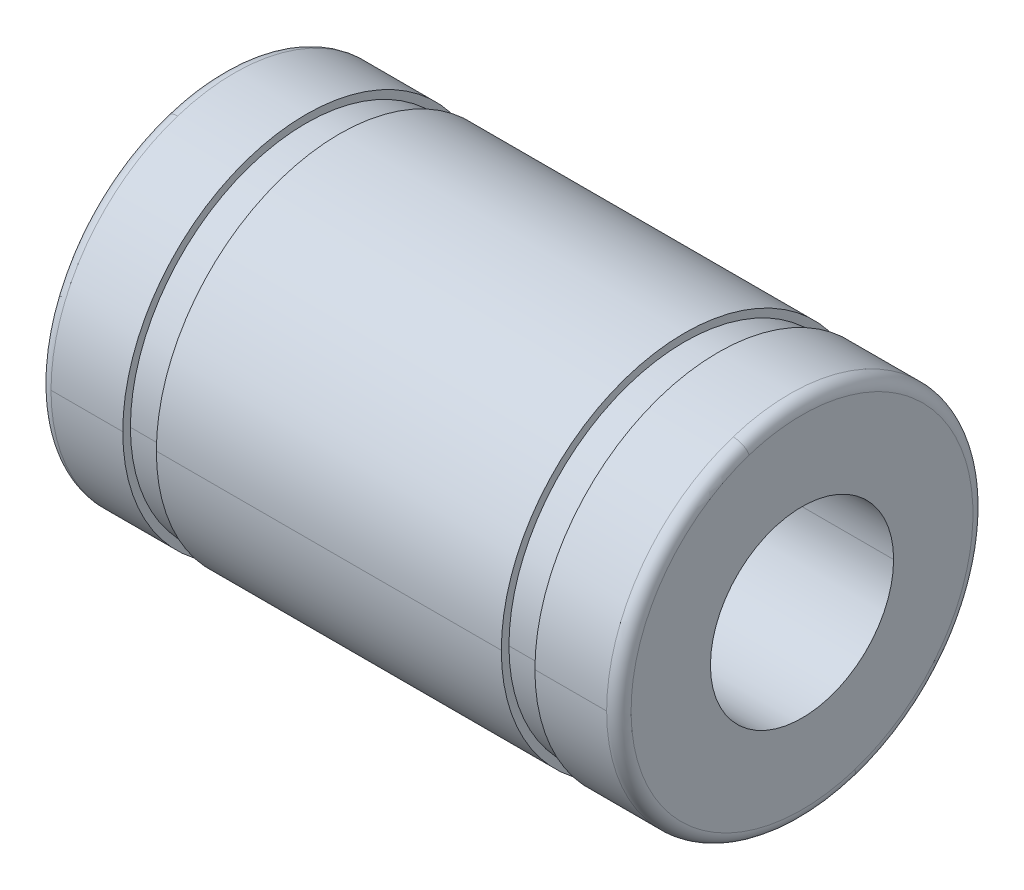
ISO-10303-21;
HEADER;
FILE_DESCRIPTION(('STEP AP214'),'2;1');
FILE_NAME('part.step','',(''),(''),'','','');
FILE_SCHEMA(('AUTOMOTIVE_DESIGN { 1 0 10303 214 1 1 1 1 }'));
ENDSEC;
DATA;
#1=APPLICATION_CONTEXT('core data for automotive mechanical design processes');
#2=APPLICATION_PROTOCOL_DEFINITION('international standard','automotive_design',2000,#1);
#3=PRODUCT_CONTEXT('',#1,'mechanical');
#4=PRODUCT('Part','Part','',(#3));
#5=PRODUCT_RELATED_PRODUCT_CATEGORY('part','',(#4));
#6=PRODUCT_DEFINITION_FORMATION('','',#4);
#7=PRODUCT_DEFINITION_CONTEXT('part definition',#1,'design');
#8=PRODUCT_DEFINITION('design','',#6,#7);
#9=PRODUCT_DEFINITION_SHAPE('','',#8);
#10=(LENGTH_UNIT() NAMED_UNIT(*) SI_UNIT(.MILLI.,.METRE.));
#11=(NAMED_UNIT(*) PLANE_ANGLE_UNIT() SI_UNIT($,.RADIAN.));
#12=(NAMED_UNIT(*) SI_UNIT($,.STERADIAN.) SOLID_ANGLE_UNIT());
#13=UNCERTAINTY_MEASURE_WITH_UNIT(LENGTH_MEASURE(1.E-05),#10,'distance_accuracy_value','');
#14=(GEOMETRIC_REPRESENTATION_CONTEXT(3) GLOBAL_UNCERTAINTY_ASSIGNED_CONTEXT((#13)) GLOBAL_UNIT_ASSIGNED_CONTEXT((#10,
#11,#12)) REPRESENTATION_CONTEXT('',''));
#15=CARTESIAN_POINT('',(0.,0.,0.));
#16=DIRECTION('',(0.,0.,1.));
#17=DIRECTION('',(1.,0.,0.));
#18=AXIS2_PLACEMENT_3D('',#15,#16,#17);
#19=CARTESIAN_POINT('',(0.,5.6,0.));
#20=DIRECTION('',(-1.,0.,0.));
#21=DIRECTION('',(0.,0.,1.));
#22=AXIS2_PLACEMENT_3D('',#19,#20,#21);
#23=PLANE('',#22);
#24=CARTESIAN_POINT('',(0.,0.,0.));
#25=DIRECTION('',(1.,0.,0.));
#26=DIRECTION('',(0.,0.,-1.));
#27=AXIS2_PLACEMENT_3D('',#24,#25,#26);
#28=CIRCLE('',#27,3.);
#29=CARTESIAN_POINT('',(0.,0.,-3.));
#30=VERTEX_POINT('',#29);
#31=CARTESIAN_POINT('',(0.,0.,3.));
#32=VERTEX_POINT('',#31);
#33=EDGE_CURVE('E11',#30,#32,#28,.T.);
#34=ORIENTED_EDGE('',*,*,#33,.T.);
#35=CARTESIAN_POINT('',(0.,0.,0.));
#36=DIRECTION('',(1.,0.,0.));
#37=DIRECTION('',(0.,0.,-1.));
#38=AXIS2_PLACEMENT_3D('',#35,#36,#37);
#39=CIRCLE('',#38,3.);
#40=EDGE_CURVE('E25',#32,#30,#39,.T.);
#41=ORIENTED_EDGE('',*,*,#40,.T.);
#42=EDGE_LOOP('',(#34,#41));
#43=FACE_BOUND('',#42,.T.);
#44=CARTESIAN_POINT('',(0.,5.32591649125286,1.7304951684997));
#45=CARTESIAN_POINT('',(0.,5.29760315024354,1.81764096194259));
#46=CARTESIAN_POINT('',(0.,5.26714736635499,1.90409045959508));
#47=CARTESIAN_POINT('',(0.,5.20203227012188,2.07539163474558));
#48=CARTESIAN_POINT('',(0.,5.16737295777732,2.16024331224361));
#49=CARTESIAN_POINT('',(0.,5.0939321619346,2.32814361851157));
#50=CARTESIAN_POINT('',(0.,5.05515067843645,2.4111922472815));
#51=CARTESIAN_POINT('',(0.,4.97355954169295,2.57528660263574));
#52=CARTESIAN_POINT('',(0.,4.9307498884476,2.65633232922005));
#53=CARTESIAN_POINT('',(0.,4.84120539076773,2.81622557554584));
#54=CARTESIAN_POINT('',(0.,4.79447054633323,2.89507309528731));
#55=CARTESIAN_POINT('',(0.,4.6971882957782,3.05037999299519));
#56=CARTESIAN_POINT('',(0.,4.64664088965768,3.12683937096161));
#57=CARTESIAN_POINT('',(0.,4.54185527782808,3.27718578358765));
#58=CARTESIAN_POINT('',(0.,4.487617072119,3.35107281824727));
#59=CARTESIAN_POINT('',(0.,4.37558052865639,3.49609654504506));
#60=CARTESIAN_POINT('',(0.,4.31778219090286,3.56723323718322));
#61=CARTESIAN_POINT('',(0.,4.19876462381749,3.70658490411483));
#62=CARTESIAN_POINT('',(0.,4.13754539448567,3.77479987890827));
#63=CARTESIAN_POINT('',(0.,4.01183352694158,3.90814377538189));
#64=CARTESIAN_POINT('',(0.,3.94734088872931,3.97327269706207));
#65=CARTESIAN_POINT('',(0.,3.81523757178182,4.10028758601061));
#66=CARTESIAN_POINT('',(0.,3.74762689304659,4.16217355327898));
#67=CARTESIAN_POINT('',(0.,3.60945037511548,4.28255344469395));
#68=CARTESIAN_POINT('',(0.,3.5388845359196,4.34104736884057));
#69=CARTESIAN_POINT('',(0.,3.39496769635055,4.45450225702377));
#70=CARTESIAN_POINT('',(0.,3.32161669597739,4.50946322106035));
#71=CARTESIAN_POINT('',(0.,3.17230624303957,4.61571978324752));
#72=CARTESIAN_POINT('',(0.,3.09634679047491,4.66701538139812));
#73=CARTESIAN_POINT('',(0.,2.9420024261283,4.76581763622429));
#74=CARTESIAN_POINT('',(0.,2.86361751434634,4.81332429289987));
#75=CARTESIAN_POINT('',(0.,2.7046110676834,4.90443421707902));
#76=CARTESIAN_POINT('',(0.,2.62398953280241,4.94803748458259));
#77=CARTESIAN_POINT('',(0.,2.46070406428052,5.03123558632712));
#78=CARTESIAN_POINT('',(0.,2.37804013063963,5.07083042056807));
#79=CARTESIAN_POINT('',(0.,2.21086900925457,5.14591626836356));
#80=CARTESIAN_POINT('',(0.,2.12636182151041,5.18140728191811));
#81=CARTESIAN_POINT('',(0.,1.95570777713607,5.24819998738049));
#82=CARTESIAN_POINT('',(0.,1.86956092050588,5.27950167928833));
#83=CARTESIAN_POINT('',(0.,1.69583507368268,5.33784033293979));
#84=CARTESIAN_POINT('',(0.,1.60825608348966,5.36487729468341));
#85=CARTESIAN_POINT('',(0.,1.43187695499918,5.41462135359744));
#86=CARTESIAN_POINT('',(0.,1.34307681670172,5.43732845076785));
#87=CARTESIAN_POINT('',(0.,1.16446931931348,5.47835807714945));
#88=CARTESIAN_POINT('',(0.,1.0746619602227,5.49668060636066));
#89=CARTESIAN_POINT('',(0.,0.894256375042082,5.52889695624612));
#90=CARTESIAN_POINT('',(0.,0.803658148952239,5.54279077692039));
#91=CARTESIAN_POINT('',(0.,0.621889088835604,5.56611623830102));
#92=CARTESIAN_POINT('',(0.,0.530718254808811,5.57554787900739));
#93=CARTESIAN_POINT('',(0.,0.348023617343068,5.58992625880365));
#94=CARTESIAN_POINT('',(0.,0.256499813904118,5.59487299789354));
#95=CARTESIAN_POINT('',(0.,0.0733197264730848,5.6002696573291));
#96=CARTESIAN_POINT('',(0.,-0.0183365575189982,5.60071957767477));
#97=CARTESIAN_POINT('',(0.,-0.20156079804002,5.59712151572436));
#98=CARTESIAN_POINT('',(0.,-0.29312875456896,5.59307353342828));
#99=CARTESIAN_POINT('',(0.,-0.475955744936008,5.58048941813829));
#100=CARTESIAN_POINT('',(0.,-0.567214778774118,5.57195328514438));
#101=CARTESIAN_POINT('',(0.,-0.749204072753645,5.55041343275079));
#102=CARTESIAN_POINT('',(0.,-0.839934332895063,5.53740971335111));
#103=CARTESIAN_POINT('',(0.,-1.02064750233749,5.50696601524499));
#104=CARTESIAN_POINT('',(0.,-1.1106304116385,5.48952603653856));
#105=CARTESIAN_POINT('',(0.,-1.28963210269004,5.45025183425521));
#106=CARTESIAN_POINT('',(0.,-1.37865088444057,5.4284176106783));
#107=CARTESIAN_POINT('',(0.,-1.55550986634878,5.38040751921104));
#108=CARTESIAN_POINT('',(0.,-1.64335006650647,5.35423165132069));
#109=CARTESIAN_POINT('',(0.,-1.81764027049292,5.29760133118504));
#110=CARTESIAN_POINT('',(0.,-1.90409027432169,5.26714687893974));
#111=CARTESIAN_POINT('',(0.,-2.07539182001895,5.20203275753714));
#112=CARTESIAN_POINT('',(0.,-2.16024336188745,5.16737308837985));
#113=CARTESIAN_POINT('',(0.,-2.3281435688677,5.09393203133209));
#114=CARTESIAN_POINT('',(0.,-2.41119223397946,5.05515064344162));
#115=CARTESIAN_POINT('',(0.,-2.57528661593776,4.9735595766878));
#116=CARTESIAN_POINT('',(0.,-2.65633233278431,4.93074989782444));
#117=CARTESIAN_POINT('',(0.,-2.81622557198156,4.8412053813909));
#118=CARTESIAN_POINT('',(0.,-2.89507309433226,4.79447054382072));
#119=CARTESIAN_POINT('',(0.,-3.05037999395023,4.69718829829072));
#120=CARTESIAN_POINT('',(0.,-3.1268393712175,4.64664089033091));
#121=CARTESIAN_POINT('',(0.,-3.27718578333174,4.54185527715486));
#122=CARTESIAN_POINT('',(0.,-3.3510728181787,4.48761707193862));
#123=CARTESIAN_POINT('',(0.,-3.49609654511363,4.37558052883679));
#124=CARTESIAN_POINT('',(0.,-3.56723323720159,4.3177821909512));
#125=CARTESIAN_POINT('',(0.,-3.70658490409644,4.19876462376916));
#126=CARTESIAN_POINT('',(0.,-3.77479987890333,4.13754539447272));
#127=CARTESIAN_POINT('',(0.,-3.9081437753868,4.01183352695453));
#128=CARTESIAN_POINT('',(0.,-3.97327269706338,3.94734088873279));
#129=CARTESIAN_POINT('',(0.,-4.10028758600929,3.81523757177835));
#130=CARTESIAN_POINT('',(0.,-4.16217355327862,3.74762689304567));
#131=CARTESIAN_POINT('',(0.,-4.2825534446943,3.60945037511642));
#132=CARTESIAN_POINT('',(0.,-4.34104736884066,3.53888453591985));
#133=CARTESIAN_POINT('',(0.,-4.45450225702367,3.39496769635031));
#134=CARTESIAN_POINT('',(0.,-4.50946322106032,3.32161669597733));
#135=CARTESIAN_POINT('',(0.,-4.61571978324754,3.17230624303964));
#136=CARTESIAN_POINT('',(0.,-4.66701538139812,3.09634679047494));
#137=CARTESIAN_POINT('',(0.,-4.76581763622427,2.94200242612829));
#138=CARTESIAN_POINT('',(0.,-4.81332429289986,2.86361751434635));
#139=CARTESIAN_POINT('',(0.,-4.90443421707902,2.70461106768341));
#140=CARTESIAN_POINT('',(0.,-4.94803748458259,2.62398953280242));
#141=CARTESIAN_POINT('',(0.,-5.03123558632711,2.46070406428053));
#142=CARTESIAN_POINT('',(0.,-5.07083042056806,2.37804013063964));
#143=CARTESIAN_POINT('',(0.,-5.14591626836356,2.21086900925458));
#144=CARTESIAN_POINT('',(0.,-5.18140728191812,2.12636182151042));
#145=CARTESIAN_POINT('',(0.,-5.24819998738047,1.95570777713609));
#146=CARTESIAN_POINT('',(0.,-5.27950167928825,1.86956092050591));
#147=CARTESIAN_POINT('',(0.,-5.33784033293985,1.69583507368267));
#148=CARTESIAN_POINT('',(0.,-5.36487729468366,1.6082560834896));
#149=CARTESIAN_POINT('',(0.,-5.41462135359718,1.43187695499926));
#150=CARTESIAN_POINT('',(0.,-5.43732845076688,1.34307681670199));
#151=CARTESIAN_POINT('',(0.,-5.47835807715041,1.16446931931323));
#152=CARTESIAN_POINT('',(0.,-5.49668060636424,1.07466196022174));
#153=CARTESIAN_POINT('',(0.,-5.52889695624254,0.894256375043066));
#154=CARTESIAN_POINT('',(0.,-5.54279077690702,0.803658148955882));
#155=CARTESIAN_POINT('',(0.,-5.56611623831439,0.621889088831987));
#156=CARTESIAN_POINT('',(0.,-5.57554787905729,0.530718254795276));
#157=CARTESIAN_POINT('',(0.,-5.58992625875374,0.348023617356626));
#158=CARTESIAN_POINT('',(0.,-5.59487299770729,0.256499813954687));
#159=CARTESIAN_POINT('',(0.,-5.60026965751534,0.0733197264225391));
#160=CARTESIAN_POINT('',(0.,-5.60071957836984,-0.0183365577076699));
#161=CARTESIAN_POINT('',(0.,-5.59712151502929,-0.201560797851326));
#162=CARTESIAN_POINT('',(0.,-5.59307353083425,-0.293128753864773));
#163=CARTESIAN_POINT('',(0.,-5.58048942073232,-0.47595574564017));
#164=CARTESIAN_POINT('',(0.,-5.57195329482543,-0.567214781402119));
#165=CARTESIAN_POINT('',(0.,-5.55041342306975,-0.749204070125617));
#166=CARTESIAN_POINT('',(0.,-5.53740967722095,-0.839934323087166));
#167=CARTESIAN_POINT('',(0.,-5.50696605137515,-1.02064751214536));
#168=CARTESIAN_POINT('',(0.,-5.48952617137815,-1.11063044824201));
#169=CARTESIAN_POINT('',(0.,-5.45025169941563,-1.28963206608651));
#170=CARTESIAN_POINT('',(0.,-5.42841710745012,-1.37865074783437));
#171=CARTESIAN_POINT('',(0.,-5.38040802243922,-1.55551000295496));
#172=CARTESIAN_POINT('',(0.,-5.35423352939385,-1.64335057632769));
#173=CARTESIAN_POINT('',(0.,-5.32591649125286,-1.73049516849968));
#174=B_SPLINE_CURVE_WITH_KNOTS('',3,(#44,#45,#46,#47,#48,#49,#50,#51,#52,#53,#54,#55,#56,#57,
#58,#59,#60,#61,#62,#63,#64,#65,#66,#67,#68,#69,#70,#71,#72,#73,#74,#75,#76,#77,#78,#79,#80,#81,
#82,#83,#84,#85,#86,#87,#88,#89,#90,#91,#92,#93,#94,#95,#96,#97,#98,#99,#100,#101,#102,#103,
#104,#105,#106,#107,#108,#109,#110,#111,#112,#113,#114,#115,#116,#117,#118,#119,#120,#121,#122,
#123,#124,#125,#126,#127,#128,#129,#130,#131,#132,#133,#134,#135,#136,#137,#138,#139,#140,#141,
#142,#143,#144,#145,#146,#147,#148,#149,#150,#151,#152,#153,#154,#155,#156,#157,#158,#159,#160,
#161,#162,#163,#164,#165,#166,#167,#168,#169,#170,#171,#172,#173),.UNSPECIFIED.,.F.,.F.,(4,2,2,
2,2,2,2,2,2,2,2,2,2,2,2,2,2,2,2,2,2,2,2,2,2,2,2,2,2,2,2,2,2,2,2,2,2,2,2,2,2,2,2,2,2,2,2,2,2,2,2,
2,2,2,2,2,2,2,2,2,2,2,2,2,4),(0.,0.274861759456618,0.549723518913234,0.824585278369852,
1.09944703782647,1.37430879728309,1.6491705567397,1.92403231619632,2.19889407565294,
2.47375583510956,2.74861759456617,3.02347935402279,3.29834111347941,3.57320287293602,
3.84806463239264,4.12292639184926,4.39778815130588,4.67264991076249,4.94751167021911,
5.22237342967573,5.49723518913235,5.77209694858896,6.04695870804558,6.3218204675022,
6.59668222695881,6.87154398641543,7.14640574587205,7.42126750532867,7.69612926478528,
7.9709910242419,8.24585278369852,8.52071454315513,8.79557630261175,9.07043806206837,
9.34529982152499,9.6201615809816,9.89502334043822,10.1698850998948,10.4447468593515,
10.7196086188081,10.9944703782647,11.2693321377213,11.5441938971779,11.8190556566345,
12.0939174160912,12.3687791755478,12.6436409350044,12.918502694461,13.1933644539176,
13.4682262133743,13.7430879728309,14.0179497322875,14.2928114917441,14.5676732512007,
14.8425350106573,15.1173967701139,15.3922585295706,15.6671202890272,15.9419820484838,
16.2168438079404,16.491705567397,16.7665673268537,17.0414290863103,17.3162908457669,
17.5911526052235),.UNSPECIFIED.);
#175=CARTESIAN_POINT('',(0.,5.32591649125286,1.7304951684997));
#176=VERTEX_POINT('',#175);
#177=CARTESIAN_POINT('',(0.,-5.32591649125286,-1.7304951684997));
#178=VERTEX_POINT('',#177);
#179=EDGE_CURVE('E439',#176,#178,#174,.T.);
#180=ORIENTED_EDGE('',*,*,#179,.F.);
#181=CARTESIAN_POINT('',(0.,-5.32591649125286,-1.7304951684997));
#182=CARTESIAN_POINT('',(0.,-5.29760315024354,-1.81764096194259));
#183=CARTESIAN_POINT('',(0.,-5.26714736635499,-1.90409045959508));
#184=CARTESIAN_POINT('',(0.,-5.20203227012188,-2.07539163474558));
#185=CARTESIAN_POINT('',(0.,-5.16737295777732,-2.16024331224361));
#186=CARTESIAN_POINT('',(0.,-5.0939321619346,-2.32814361851157));
#187=CARTESIAN_POINT('',(0.,-5.05515067843646,-2.4111922472815));
#188=CARTESIAN_POINT('',(0.,-4.97355954169295,-2.57528660263574));
#189=CARTESIAN_POINT('',(0.,-4.9307498884476,-2.65633232922005));
#190=CARTESIAN_POINT('',(0.,-4.84120539076774,-2.81622557554584));
#191=CARTESIAN_POINT('',(0.,-4.79447054633323,-2.89507309528731));
#192=CARTESIAN_POINT('',(0.,-4.6971882957782,-3.05037999299519));
#193=CARTESIAN_POINT('',(0.,-4.64664088965768,-3.1268393709616));
#194=CARTESIAN_POINT('',(0.,-4.54185527782808,-3.27718578358765));
#195=CARTESIAN_POINT('',(0.,-4.487617072119,-3.35107281824727));
#196=CARTESIAN_POINT('',(0.,-4.37558052865639,-3.49609654504506));
#197=CARTESIAN_POINT('',(0.,-4.31778219090286,-3.56723323718322));
#198=CARTESIAN_POINT('',(0.,-4.1987646238175,-3.70658490411482));
#199=CARTESIAN_POINT('',(0.,-4.13754539448567,-3.77479987890826));
#200=CARTESIAN_POINT('',(0.,-4.01183352694158,-3.90814377538189));
#201=CARTESIAN_POINT('',(0.,-3.94734088872931,-3.97327269706207));
#202=CARTESIAN_POINT('',(0.,-3.81523757178182,-4.10028758601061));
#203=CARTESIAN_POINT('',(0.,-3.74762689304659,-4.16217355327897));
#204=CARTESIAN_POINT('',(0.,-3.60945037511548,-4.28255344469395));
#205=CARTESIAN_POINT('',(0.,-3.5388845359196,-4.34104736884057));
#206=CARTESIAN_POINT('',(0.,-3.39496769635055,-4.45450225702376));
#207=CARTESIAN_POINT('',(0.,-3.32161669597739,-4.50946322106035));
#208=CARTESIAN_POINT('',(0.,-3.17230624303957,-4.61571978324752));
#209=CARTESIAN_POINT('',(0.,-3.09634679047491,-4.66701538139811));
#210=CARTESIAN_POINT('',(0.,-2.9420024261283,-4.76581763622429));
#211=CARTESIAN_POINT('',(0.,-2.86361751434634,-4.81332429289986));
#212=CARTESIAN_POINT('',(0.,-2.7046110676834,-4.90443421707902));
#213=CARTESIAN_POINT('',(0.,-2.62398953280241,-4.94803748458259));
#214=CARTESIAN_POINT('',(0.,-2.46070406428053,-5.03123558632712));
#215=CARTESIAN_POINT('',(0.,-2.37804013063963,-5.07083042056807));
#216=CARTESIAN_POINT('',(0.,-2.21086900925457,-5.14591626836356));
#217=CARTESIAN_POINT('',(0.,-2.12636182151042,-5.1814072819181));
#218=CARTESIAN_POINT('',(0.,-1.95570777713608,-5.24819998738049));
#219=CARTESIAN_POINT('',(0.,-1.86956092050589,-5.27950167928832));
#220=CARTESIAN_POINT('',(0.,-1.69583507368269,-5.33784033293978));
#221=CARTESIAN_POINT('',(0.,-1.60825608348967,-5.36487729468341));
#222=CARTESIAN_POINT('',(0.,-1.43187695499919,-5.41462135359744));
#223=CARTESIAN_POINT('',(0.,-1.34307681670172,-5.43732845076784));
#224=CARTESIAN_POINT('',(0.,-1.16446931931348,-5.47835807714945));
#225=CARTESIAN_POINT('',(0.,-1.07466196022271,-5.49668060636066));
#226=CARTESIAN_POINT('',(0.,-0.894256375042089,-5.52889695624612));
#227=CARTESIAN_POINT('',(0.,-0.803658148952246,-5.54279077692039));
#228=CARTESIAN_POINT('',(0.,-0.621889088835609,-5.56611623830102));
#229=CARTESIAN_POINT('',(0.,-0.530718254808816,-5.57554787900739));
#230=CARTESIAN_POINT('',(0.,-0.348023617343072,-5.58992625880365));
#231=CARTESIAN_POINT('',(0.,-0.256499813904122,-5.59487299789354));
#232=CARTESIAN_POINT('',(0.,-0.0733197264730882,-5.6002696573291));
#233=CARTESIAN_POINT('',(0.,0.0183365575189954,-5.60071957767477));
#234=CARTESIAN_POINT('',(0.,0.201560798040017,-5.59712151572436));
#235=CARTESIAN_POINT('',(0.,0.293128754568954,-5.59307353342828));
#236=CARTESIAN_POINT('',(0.,0.475955744936002,-5.58048941813829));
#237=CARTESIAN_POINT('',(0.,0.567214778774111,-5.57195328514439));
#238=CARTESIAN_POINT('',(0.,0.749204072753638,-5.55041343275079));
#239=CARTESIAN_POINT('',(0.,0.839934332895055,-5.53740971335111));
#240=CARTESIAN_POINT('',(0.,1.02064750233748,-5.50696601524499));
#241=CARTESIAN_POINT('',(0.,1.1106304116385,-5.48952603653856));
#242=CARTESIAN_POINT('',(0.,1.28963210269004,-5.45025183425521));
#243=CARTESIAN_POINT('',(0.,1.37865088444057,-5.4284176106783));
#244=CARTESIAN_POINT('',(0.,1.55550986634878,-5.38040751921104));
#245=CARTESIAN_POINT('',(0.,1.64335006650646,-5.35423165132069));
#246=CARTESIAN_POINT('',(0.,1.81764027049291,-5.29760133118504));
#247=CARTESIAN_POINT('',(0.,1.90409027432168,-5.26714687893974));
#248=CARTESIAN_POINT('',(0.,2.07539182001895,-5.20203275753715));
#249=CARTESIAN_POINT('',(0.,2.16024336188745,-5.16737308837985));
#250=CARTESIAN_POINT('',(0.,2.3281435688677,-5.09393203133209));
#251=CARTESIAN_POINT('',(0.,2.41119223397945,-5.05515064344162));
#252=CARTESIAN_POINT('',(0.,2.57528661593776,-4.9735595766878));
#253=CARTESIAN_POINT('',(0.,2.65633233278431,-4.93074989782444));
#254=CARTESIAN_POINT('',(0.,2.81622557198155,-4.8412053813909));
#255=CARTESIAN_POINT('',(0.,2.89507309433225,-4.79447054382072));
#256=CARTESIAN_POINT('',(0.,3.05037999395022,-4.69718829829073));
#257=CARTESIAN_POINT('',(0.,3.12683937121749,-4.64664089033091));
#258=CARTESIAN_POINT('',(0.,3.27718578333173,-4.54185527715486));
#259=CARTESIAN_POINT('',(0.,3.35107281817869,-4.48761707193862));
#260=CARTESIAN_POINT('',(0.,3.49609654511362,-4.37558052883679));
#261=CARTESIAN_POINT('',(0.,3.56723323720158,-4.3177821909512));
#262=CARTESIAN_POINT('',(0.,3.70658490409644,-4.19876462376917));
#263=CARTESIAN_POINT('',(0.,3.77479987890333,-4.13754539447273));
#264=CARTESIAN_POINT('',(0.,3.9081437753868,-4.01183352695454));
#265=CARTESIAN_POINT('',(0.,3.97327269706338,-3.94734088873279));
#266=CARTESIAN_POINT('',(0.,4.10028758600928,-3.81523757177836));
#267=CARTESIAN_POINT('',(0.,4.16217355327861,-3.74762689304567));
#268=CARTESIAN_POINT('',(0.,4.28255344469429,-3.60945037511642));
#269=CARTESIAN_POINT('',(0.,4.34104736884065,-3.53888453591986));
#270=CARTESIAN_POINT('',(0.,4.45450225702366,-3.39496769635032));
#271=CARTESIAN_POINT('',(0.,4.50946322106031,-3.32161669597734));
#272=CARTESIAN_POINT('',(0.,4.61571978324754,-3.17230624303965));
#273=CARTESIAN_POINT('',(0.,4.66701538139811,-3.09634679047495));
#274=CARTESIAN_POINT('',(0.,4.76581763622427,-2.9420024261283));
#275=CARTESIAN_POINT('',(0.,4.81332429289985,-2.86361751434635));
#276=CARTESIAN_POINT('',(0.,4.90443421707901,-2.70461106768342));
#277=CARTESIAN_POINT('',(0.,4.94803748458259,-2.62398953280243));
#278=CARTESIAN_POINT('',(0.,5.03123558632711,-2.46070406428054));
#279=CARTESIAN_POINT('',(0.,5.07083042056805,-2.37804013063964));
#280=CARTESIAN_POINT('',(0.,5.14591626836356,-2.21086900925459));
#281=CARTESIAN_POINT('',(0.,5.18140728191812,-2.12636182151043));
#282=CARTESIAN_POINT('',(0.,5.24819998738046,-1.95570777713609));
#283=CARTESIAN_POINT('',(0.,5.27950167928825,-1.86956092050592));
#284=CARTESIAN_POINT('',(0.,5.33784033293985,-1.69583507368268));
#285=CARTESIAN_POINT('',(0.,5.36487729468366,-1.60825608348961));
#286=CARTESIAN_POINT('',(0.,5.41462135359717,-1.43187695499927));
#287=CARTESIAN_POINT('',(0.,5.43732845076688,-1.343076816702));
#288=CARTESIAN_POINT('',(0.,5.47835807715041,-1.16446931931324));
#289=CARTESIAN_POINT('',(0.,5.49668060636424,-1.07466196022175));
#290=CARTESIAN_POINT('',(0.,5.52889695624254,-0.894256375043076));
#291=CARTESIAN_POINT('',(0.,5.54279077690701,-0.803658148955891));
#292=CARTESIAN_POINT('',(0.,5.56611623831439,-0.621889088831995));
#293=CARTESIAN_POINT('',(0.,5.57554787905729,-0.530718254795286));
#294=CARTESIAN_POINT('',(0.,5.58992625875374,-0.348023617356638));
#295=CARTESIAN_POINT('',(0.,5.59487299770729,-0.256499813954699));
#296=CARTESIAN_POINT('',(0.,5.60026965751534,-0.0733197264225513));
#297=CARTESIAN_POINT('',(0.,5.60071957836983,0.0183365577076577));
#298=CARTESIAN_POINT('',(0.,5.59712151502929,0.201560797851314));
#299=CARTESIAN_POINT('',(0.,5.59307353083425,0.293128753864761));
#300=CARTESIAN_POINT('',(0.,5.58048942073232,0.475955745640158));
#301=CARTESIAN_POINT('',(0.,5.57195329482543,0.567214781402107));
#302=CARTESIAN_POINT('',(0.,5.55041342306975,0.749204070125607));
#303=CARTESIAN_POINT('',(0.,5.53740967722095,0.839934323087157));
#304=CARTESIAN_POINT('',(0.,5.50696605137515,1.02064751214535));
#305=CARTESIAN_POINT('',(0.,5.48952617137815,1.110630448242));
#306=CARTESIAN_POINT('',(0.,5.45025169941563,1.28963206608651));
#307=CARTESIAN_POINT('',(0.,5.42841710745012,1.37865074783436));
#308=CARTESIAN_POINT('',(0.,5.38040802243923,1.55551000295495));
#309=CARTESIAN_POINT('',(0.,5.35423352939385,1.64335057632768));
#310=CARTESIAN_POINT('',(0.,5.32591649125287,1.73049516849967));
#311=B_SPLINE_CURVE_WITH_KNOTS('',3,(#181,#182,#183,#184,#185,#186,#187,#188,#189,#190,#191,
#192,#193,#194,#195,#196,#197,#198,#199,#200,#201,#202,#203,#204,#205,#206,#207,#208,#209,#210,
#211,#212,#213,#214,#215,#216,#217,#218,#219,#220,#221,#222,#223,#224,#225,#226,#227,#228,#229,
#230,#231,#232,#233,#234,#235,#236,#237,#238,#239,#240,#241,#242,#243,#244,#245,#246,#247,#248,
#249,#250,#251,#252,#253,#254,#255,#256,#257,#258,#259,#260,#261,#262,#263,#264,#265,#266,#267,
#268,#269,#270,#271,#272,#273,#274,#275,#276,#277,#278,#279,#280,#281,#282,#283,#284,#285,#286,
#287,#288,#289,#290,#291,#292,#293,#294,#295,#296,#297,#298,#299,#300,#301,#302,#303,#304,#305,
#306,#307,#308,#309,#310),.UNSPECIFIED.,.F.,.F.,(4,2,2,2,2,2,2,2,2,2,2,2,2,2,2,2,2,2,2,2,2,2,2,
2,2,2,2,2,2,2,2,2,2,2,2,2,2,2,2,2,2,2,2,2,2,2,2,2,2,2,2,2,2,2,2,2,2,2,2,2,2,2,2,2,4),(0.,
0.274861759456618,0.549723518913235,0.824585278369851,1.09944703782647,1.37430879728309,
1.6491705567397,1.92403231619632,2.19889407565294,2.47375583510955,2.74861759456617,
3.02347935402279,3.2983411134794,3.57320287293602,3.84806463239264,4.12292639184926,
4.39778815130587,4.67264991076249,4.94751167021911,5.22237342967573,5.49723518913234,
5.77209694858896,6.04695870804558,6.32182046750219,6.59668222695881,6.87154398641543,
7.14640574587205,7.42126750532866,7.69612926478528,7.9709910242419,8.24585278369851,
8.52071454315513,8.79557630261175,9.07043806206836,9.34529982152498,9.6201615809816,
9.89502334043822,10.1698850998948,10.4447468593514,10.7196086188081,10.9944703782647,
11.2693321377213,11.5441938971779,11.8190556566345,12.0939174160912,12.3687791755478,
12.6436409350044,12.918502694461,13.1933644539176,13.4682262133742,13.7430879728309,
14.0179497322875,14.2928114917441,14.5676732512007,14.8425350106573,15.1173967701139,
15.3922585295706,15.6671202890272,15.9419820484838,16.2168438079404,16.491705567397,
16.7665673268536,17.0414290863103,17.3162908457669,17.5911526052235),.UNSPECIFIED.);
#312=EDGE_CURVE('E441',#178,#176,#311,.T.);
#313=ORIENTED_EDGE('',*,*,#312,.F.);
#314=EDGE_LOOP('',(#180,#313));
#315=FACE_BOUND('',#314,.T.);
#316=ADVANCED_FACE('F16',(#43,#315),#23,.T.);
#317=CARTESIAN_POINT('',(0.40000000000003,0.,0.));
#318=DIRECTION('',(1.,0.,0.));
#319=DIRECTION('',(0.,-0.309016994374947,0.951056516295154));
#320=AXIS2_PLACEMENT_3D('',#317,#318,#319);
#321=TOROIDAL_SURFACE('',#320,5.6,0.40000000000003);
#322=CARTESIAN_POINT('',(0.40000000000003,-5.32591649125286,-1.7304951684997));
#323=DIRECTION('',(0.,0.309016994374948,-0.951056516295154));
#324=DIRECTION('',(0.,-0.951056516295154,-0.309016994374948));
#325=AXIS2_PLACEMENT_3D('',#322,#323,#324);
#326=CIRCLE('',#325,0.40000000000003);
#327=CARTESIAN_POINT('',(0.399999999999999,-5.70633909777095,-1.85410196624969));
#328=VERTEX_POINT('',#327);
#329=EDGE_CURVE('E360',#328,#178,#326,.T.);
#330=ORIENTED_EDGE('',*,*,#329,.T.);
#331=ORIENTED_EDGE('',*,*,#312,.T.);
#332=CARTESIAN_POINT('',(0.40000000000003,5.32591649125286,1.7304951684997));
#333=DIRECTION('',(0.,-0.309016994374948,0.951056516295154));
#334=DIRECTION('',(0.,0.951056516295154,0.309016994374948));
#335=AXIS2_PLACEMENT_3D('',#332,#333,#334);
#336=CIRCLE('',#335,0.40000000000003);
#337=CARTESIAN_POINT('',(0.399999999999999,5.70633909777095,1.85410196624969));
#338=VERTEX_POINT('',#337);
#339=EDGE_CURVE('E355',#338,#176,#336,.T.);
#340=ORIENTED_EDGE('',*,*,#339,.F.);
#341=CARTESIAN_POINT('',(0.4,0.,0.));
#342=DIRECTION('',(1.,0.,0.));
#343=DIRECTION('',(0.,0.,-1.));
#344=AXIS2_PLACEMENT_3D('',#341,#342,#343);
#345=CIRCLE('',#344,6.);
#346=CARTESIAN_POINT('',(0.4,0.,-6.));
#347=VERTEX_POINT('',#346);
#348=EDGE_CURVE('E350',#347,#338,#345,.T.);
#349=ORIENTED_EDGE('',*,*,#348,.F.);
#350=CARTESIAN_POINT('',(0.4,0.,0.));
#351=DIRECTION('',(1.,0.,0.));
#352=DIRECTION('',(0.,0.,-1.));
#353=AXIS2_PLACEMENT_3D('',#350,#351,#352);
#354=CIRCLE('',#353,6.);
#355=EDGE_CURVE('E345',#328,#347,#354,.T.);
#356=ORIENTED_EDGE('',*,*,#355,.F.);
#357=EDGE_LOOP('',(#330,#331,#340,#349,#356));
#358=FACE_BOUND('',#357,.T.);
#359=ADVANCED_FACE('F368',(#358),#321,.T.);
#360=CARTESIAN_POINT('',(19.,0.,0.));
#361=DIRECTION('',(1.,0.,0.));
#362=DIRECTION('',(0.,1.,0.));
#363=AXIS2_PLACEMENT_3D('',#360,#361,#362);
#364=CYLINDRICAL_SURFACE('',#363,6.);
#365=DIRECTION('',(1.,0.,0.));
#366=VECTOR('',#365,1.);
#367=CARTESIAN_POINT('',(0.399999999999999,0.,6.));
#368=LINE('',#367,#366);
#369=CARTESIAN_POINT('',(0.399999999999999,0.,6.));
#370=VERTEX_POINT('',#369);
#371=CARTESIAN_POINT('',(2.75,0.,6.));
#372=VERTEX_POINT('',#371);
#373=EDGE_CURVE('E340',#370,#372,#368,.T.);
#374=ORIENTED_EDGE('',*,*,#373,.F.);
#375=CARTESIAN_POINT('',(0.4,0.,0.));
#376=DIRECTION('',(1.,0.,0.));
#377=DIRECTION('',(0.,0.,-1.));
#378=AXIS2_PLACEMENT_3D('',#375,#376,#377);
#379=CIRCLE('',#378,6.);
#380=EDGE_CURVE('E335',#370,#328,#379,.T.);
#381=ORIENTED_EDGE('',*,*,#380,.T.);
#382=ORIENTED_EDGE('',*,*,#355,.T.);
#383=DIRECTION('',(1.,0.,0.));
#384=VECTOR('',#383,1.);
#385=CARTESIAN_POINT('',(0.399999999999999,0.,-6.));
#386=LINE('',#385,#384);
#387=CARTESIAN_POINT('',(2.75,0.,-6.));
#388=VERTEX_POINT('',#387);
#389=EDGE_CURVE('E331',#347,#388,#386,.T.);
#390=ORIENTED_EDGE('',*,*,#389,.T.);
#391=CARTESIAN_POINT('',(2.75,0.,0.));
#392=DIRECTION('',(1.,0.,0.));
#393=DIRECTION('',(0.,0.,-1.));
#394=AXIS2_PLACEMENT_3D('',#391,#392,#393);
#395=CIRCLE('',#394,6.);
#396=EDGE_CURVE('E326',#372,#388,#395,.T.);
#397=ORIENTED_EDGE('',*,*,#396,.F.);
#398=EDGE_LOOP('',(#374,#381,#382,#390,#397));
#399=FACE_BOUND('',#398,.T.);
#400=ADVANCED_FACE('F377',(#399),#364,.T.);
#401=CARTESIAN_POINT('',(2.75,5.75,0.));
#402=DIRECTION('',(1.,0.,0.));
#403=DIRECTION('',(0.,0.,-1.));
#404=AXIS2_PLACEMENT_3D('',#401,#402,#403);
#405=PLANE('',#404);
#406=CARTESIAN_POINT('',(2.75,0.,0.));
#407=DIRECTION('',(1.,0.,0.));
#408=DIRECTION('',(0.,0.,-1.));
#409=AXIS2_PLACEMENT_3D('',#406,#407,#408);
#410=CIRCLE('',#409,6.);
#411=EDGE_CURVE('E321',#388,#372,#410,.T.);
#412=ORIENTED_EDGE('',*,*,#411,.T.);
#413=ORIENTED_EDGE('',*,*,#396,.T.);
#414=EDGE_LOOP('',(#412,#413));
#415=FACE_BOUND('',#414,.T.);
#416=CARTESIAN_POINT('',(2.75,0.,0.));
#417=DIRECTION('',(1.,0.,0.));
#418=DIRECTION('',(0.,0.,-1.));
#419=AXIS2_PLACEMENT_3D('',#416,#417,#418);
#420=CIRCLE('',#419,5.75);
#421=CARTESIAN_POINT('',(2.75,0.,5.75));
#422=VERTEX_POINT('',#421);
#423=CARTESIAN_POINT('',(2.75,0.,-5.75));
#424=VERTEX_POINT('',#423);
#425=EDGE_CURVE('E316',#422,#424,#420,.T.);
#426=ORIENTED_EDGE('',*,*,#425,.F.);
#427=CARTESIAN_POINT('',(2.75,0.,0.));
#428=DIRECTION('',(1.,0.,0.));
#429=DIRECTION('',(0.,0.,-1.));
#430=AXIS2_PLACEMENT_3D('',#427,#428,#429);
#431=CIRCLE('',#430,5.75);
#432=EDGE_CURVE('E311',#424,#422,#431,.T.);
#433=ORIENTED_EDGE('',*,*,#432,.F.);
#434=EDGE_LOOP('',(#426,#433));
#435=FACE_BOUND('',#434,.T.);
#436=ADVANCED_FACE('F381',(#415,#435),#405,.T.);
#437=CARTESIAN_POINT('',(19.,0.,0.));
#438=DIRECTION('',(1.,0.,0.));
#439=DIRECTION('',(0.,-1.,0.));
#440=AXIS2_PLACEMENT_3D('',#437,#438,#439);
#441=CYLINDRICAL_SURFACE('',#440,5.75);
#442=DIRECTION('',(1.,0.,0.));
#443=VECTOR('',#442,1.);
#444=CARTESIAN_POINT('',(2.75,0.,5.75));
#445=LINE('',#444,#443);
#446=CARTESIAN_POINT('',(3.85,0.,5.75));
#447=VERTEX_POINT('',#446);
#448=EDGE_CURVE('E307',#422,#447,#445,.T.);
#449=ORIENTED_EDGE('',*,*,#448,.T.);
#450=CARTESIAN_POINT('',(3.85,0.,0.));
#451=DIRECTION('',(1.,0.,0.));
#452=DIRECTION('',(0.,0.,-1.));
#453=AXIS2_PLACEMENT_3D('',#450,#451,#452);
#454=CIRCLE('',#453,5.75);
#455=CARTESIAN_POINT('',(3.85,0.,-5.75));
#456=VERTEX_POINT('',#455);
#457=EDGE_CURVE('E302',#456,#447,#454,.T.);
#458=ORIENTED_EDGE('',*,*,#457,.F.);
#459=DIRECTION('',(1.,0.,0.));
#460=VECTOR('',#459,1.);
#461=CARTESIAN_POINT('',(2.75,0.,-5.75));
#462=LINE('',#461,#460);
#463=EDGE_CURVE('E297',#424,#456,#462,.T.);
#464=ORIENTED_EDGE('',*,*,#463,.F.);
#465=ORIENTED_EDGE('',*,*,#432,.T.);
#466=EDGE_LOOP('',(#449,#458,#464,#465));
#467=FACE_BOUND('',#466,.T.);
#468=ADVANCED_FACE('F385',(#467),#441,.T.);
#469=CARTESIAN_POINT('',(19.,0.,0.));
#470=DIRECTION('',(1.,0.,0.));
#471=DIRECTION('',(0.,1.,0.));
#472=AXIS2_PLACEMENT_3D('',#469,#470,#471);
#473=CYLINDRICAL_SURFACE('',#472,5.75);
#474=ORIENTED_EDGE('',*,*,#448,.F.);
#475=ORIENTED_EDGE('',*,*,#425,.T.);
#476=ORIENTED_EDGE('',*,*,#463,.T.);
#477=CARTESIAN_POINT('',(3.85,0.,0.));
#478=DIRECTION('',(1.,0.,0.));
#479=DIRECTION('',(0.,0.,-1.));
#480=AXIS2_PLACEMENT_3D('',#477,#478,#479);
#481=CIRCLE('',#480,5.75);
#482=EDGE_CURVE('E292',#447,#456,#481,.T.);
#483=ORIENTED_EDGE('',*,*,#482,.F.);
#484=EDGE_LOOP('',(#474,#475,#476,#483));
#485=FACE_BOUND('',#484,.T.);
#486=ADVANCED_FACE('F389',(#485),#473,.T.);
#487=CARTESIAN_POINT('',(3.85,6.,0.));
#488=DIRECTION('',(-1.,0.,0.));
#489=DIRECTION('',(0.,0.,1.));
#490=AXIS2_PLACEMENT_3D('',#487,#488,#489);
#491=PLANE('',#490);
#492=ORIENTED_EDGE('',*,*,#457,.T.);
#493=ORIENTED_EDGE('',*,*,#482,.T.);
#494=EDGE_LOOP('',(#492,#493));
#495=FACE_BOUND('',#494,.T.);
#496=CARTESIAN_POINT('',(3.85,0.,0.));
#497=DIRECTION('',(1.,0.,0.));
#498=DIRECTION('',(0.,0.,-1.));
#499=AXIS2_PLACEMENT_3D('',#496,#497,#498);
#500=CIRCLE('',#499,6.);
#501=CARTESIAN_POINT('',(3.85,0.,6.));
#502=VERTEX_POINT('',#501);
#503=CARTESIAN_POINT('',(3.85,0.,-6.));
#504=VERTEX_POINT('',#503);
#505=EDGE_CURVE('E287',#502,#504,#500,.T.);
#506=ORIENTED_EDGE('',*,*,#505,.F.);
#507=CARTESIAN_POINT('',(3.85,0.,0.));
#508=DIRECTION('',(1.,0.,0.));
#509=DIRECTION('',(0.,0.,-1.));
#510=AXIS2_PLACEMENT_3D('',#507,#508,#509);
#511=CIRCLE('',#510,6.);
#512=EDGE_CURVE('E282',#504,#502,#511,.T.);
#513=ORIENTED_EDGE('',*,*,#512,.F.);
#514=EDGE_LOOP('',(#506,#513));
#515=FACE_BOUND('',#514,.T.);
#516=ADVANCED_FACE('F393',(#495,#515),#491,.T.);
#517=CARTESIAN_POINT('',(19.,0.,0.));
#518=DIRECTION('',(1.,0.,0.));
#519=DIRECTION('',(0.,-1.,0.));
#520=AXIS2_PLACEMENT_3D('',#517,#518,#519);
#521=CYLINDRICAL_SURFACE('',#520,6.);
#522=DIRECTION('',(1.,0.,0.));
#523=VECTOR('',#522,1.);
#524=CARTESIAN_POINT('',(3.85,0.,6.));
#525=LINE('',#524,#523);
#526=CARTESIAN_POINT('',(15.15,0.,6.));
#527=VERTEX_POINT('',#526);
#528=EDGE_CURVE('E278',#502,#527,#525,.T.);
#529=ORIENTED_EDGE('',*,*,#528,.T.);
#530=CARTESIAN_POINT('',(15.15,0.,0.));
#531=DIRECTION('',(1.,0.,0.));
#532=DIRECTION('',(0.,0.,-1.));
#533=AXIS2_PLACEMENT_3D('',#530,#531,#532);
#534=CIRCLE('',#533,6.);
#535=CARTESIAN_POINT('',(15.15,0.,-6.));
#536=VERTEX_POINT('',#535);
#537=EDGE_CURVE('E273',#536,#527,#534,.T.);
#538=ORIENTED_EDGE('',*,*,#537,.F.);
#539=DIRECTION('',(1.,0.,0.));
#540=VECTOR('',#539,1.);
#541=CARTESIAN_POINT('',(3.85,0.,-6.));
#542=LINE('',#541,#540);
#543=EDGE_CURVE('E268',#504,#536,#542,.T.);
#544=ORIENTED_EDGE('',*,*,#543,.F.);
#545=ORIENTED_EDGE('',*,*,#512,.T.);
#546=EDGE_LOOP('',(#529,#538,#544,#545));
#547=FACE_BOUND('',#546,.T.);
#548=ADVANCED_FACE('F397',(#547),#521,.T.);
#549=CARTESIAN_POINT('',(19.,0.,0.));
#550=DIRECTION('',(1.,0.,0.));
#551=DIRECTION('',(0.,1.,0.));
#552=AXIS2_PLACEMENT_3D('',#549,#550,#551);
#553=CYLINDRICAL_SURFACE('',#552,6.);
#554=ORIENTED_EDGE('',*,*,#528,.F.);
#555=ORIENTED_EDGE('',*,*,#505,.T.);
#556=ORIENTED_EDGE('',*,*,#543,.T.);
#557=CARTESIAN_POINT('',(15.15,0.,0.));
#558=DIRECTION('',(1.,0.,0.));
#559=DIRECTION('',(0.,0.,-1.));
#560=AXIS2_PLACEMENT_3D('',#557,#558,#559);
#561=CIRCLE('',#560,6.);
#562=EDGE_CURVE('E263',#527,#536,#561,.T.);
#563=ORIENTED_EDGE('',*,*,#562,.F.);
#564=EDGE_LOOP('',(#554,#555,#556,#563));
#565=FACE_BOUND('',#564,.T.);
#566=ADVANCED_FACE('F401',(#565),#553,.T.);
#567=CARTESIAN_POINT('',(15.15,5.75,0.));
#568=DIRECTION('',(1.,0.,0.));
#569=DIRECTION('',(0.,0.,-1.));
#570=AXIS2_PLACEMENT_3D('',#567,#568,#569);
#571=PLANE('',#570);
#572=ORIENTED_EDGE('',*,*,#537,.T.);
#573=ORIENTED_EDGE('',*,*,#562,.T.);
#574=EDGE_LOOP('',(#572,#573));
#575=FACE_BOUND('',#574,.T.);
#576=CARTESIAN_POINT('',(15.15,0.,0.));
#577=DIRECTION('',(1.,0.,0.));
#578=DIRECTION('',(0.,0.,-1.));
#579=AXIS2_PLACEMENT_3D('',#576,#577,#578);
#580=CIRCLE('',#579,5.75);
#581=CARTESIAN_POINT('',(15.15,0.,5.75));
#582=VERTEX_POINT('',#581);
#583=CARTESIAN_POINT('',(15.15,0.,-5.75));
#584=VERTEX_POINT('',#583);
#585=EDGE_CURVE('E258',#582,#584,#580,.T.);
#586=ORIENTED_EDGE('',*,*,#585,.F.);
#587=CARTESIAN_POINT('',(15.15,0.,0.));
#588=DIRECTION('',(1.,0.,0.));
#589=DIRECTION('',(0.,0.,-1.));
#590=AXIS2_PLACEMENT_3D('',#587,#588,#589);
#591=CIRCLE('',#590,5.75);
#592=EDGE_CURVE('E253',#584,#582,#591,.T.);
#593=ORIENTED_EDGE('',*,*,#592,.F.);
#594=EDGE_LOOP('',(#586,#593));
#595=FACE_BOUND('',#594,.T.);
#596=ADVANCED_FACE('F405',(#575,#595),#571,.T.);
#597=CARTESIAN_POINT('',(19.,0.,0.));
#598=DIRECTION('',(1.,0.,0.));
#599=DIRECTION('',(0.,-1.,0.));
#600=AXIS2_PLACEMENT_3D('',#597,#598,#599);
#601=CYLINDRICAL_SURFACE('',#600,5.75);
#602=DIRECTION('',(1.,0.,0.));
#603=VECTOR('',#602,1.);
#604=CARTESIAN_POINT('',(15.15,0.,5.75));
#605=LINE('',#604,#603);
#606=CARTESIAN_POINT('',(16.25,0.,5.75));
#607=VERTEX_POINT('',#606);
#608=EDGE_CURVE('E249',#582,#607,#605,.T.);
#609=ORIENTED_EDGE('',*,*,#608,.T.);
#610=CARTESIAN_POINT('',(16.25,0.,0.));
#611=DIRECTION('',(1.,0.,0.));
#612=DIRECTION('',(0.,0.,-1.));
#613=AXIS2_PLACEMENT_3D('',#610,#611,#612);
#614=CIRCLE('',#613,5.75);
#615=CARTESIAN_POINT('',(16.25,0.,-5.75));
#616=VERTEX_POINT('',#615);
#617=EDGE_CURVE('E244',#616,#607,#614,.T.);
#618=ORIENTED_EDGE('',*,*,#617,.F.);
#619=DIRECTION('',(1.,0.,0.));
#620=VECTOR('',#619,1.);
#621=CARTESIAN_POINT('',(15.15,0.,-5.75));
#622=LINE('',#621,#620);
#623=EDGE_CURVE('E239',#584,#616,#622,.T.);
#624=ORIENTED_EDGE('',*,*,#623,.F.);
#625=ORIENTED_EDGE('',*,*,#592,.T.);
#626=EDGE_LOOP('',(#609,#618,#624,#625));
#627=FACE_BOUND('',#626,.T.);
#628=ADVANCED_FACE('F409',(#627),#601,.T.);
#629=CARTESIAN_POINT('',(19.,0.,0.));
#630=DIRECTION('',(1.,0.,0.));
#631=DIRECTION('',(0.,1.,0.));
#632=AXIS2_PLACEMENT_3D('',#629,#630,#631);
#633=CYLINDRICAL_SURFACE('',#632,5.75);
#634=ORIENTED_EDGE('',*,*,#608,.F.);
#635=ORIENTED_EDGE('',*,*,#585,.T.);
#636=ORIENTED_EDGE('',*,*,#623,.T.);
#637=CARTESIAN_POINT('',(16.25,0.,0.));
#638=DIRECTION('',(1.,0.,0.));
#639=DIRECTION('',(0.,0.,-1.));
#640=AXIS2_PLACEMENT_3D('',#637,#638,#639);
#641=CIRCLE('',#640,5.75);
#642=EDGE_CURVE('E234',#607,#616,#641,.T.);
#643=ORIENTED_EDGE('',*,*,#642,.F.);
#644=EDGE_LOOP('',(#634,#635,#636,#643));
#645=FACE_BOUND('',#644,.T.);
#646=ADVANCED_FACE('F413',(#645),#633,.T.);
#647=CARTESIAN_POINT('',(16.25,6.,0.));
#648=DIRECTION('',(-1.,0.,0.));
#649=DIRECTION('',(0.,0.,1.));
#650=AXIS2_PLACEMENT_3D('',#647,#648,#649);
#651=PLANE('',#650);
#652=ORIENTED_EDGE('',*,*,#617,.T.);
#653=ORIENTED_EDGE('',*,*,#642,.T.);
#654=EDGE_LOOP('',(#652,#653));
#655=FACE_BOUND('',#654,.T.);
#656=CARTESIAN_POINT('',(16.25,0.,0.));
#657=DIRECTION('',(1.,0.,0.));
#658=DIRECTION('',(0.,0.,-1.));
#659=AXIS2_PLACEMENT_3D('',#656,#657,#658);
#660=CIRCLE('',#659,6.);
#661=CARTESIAN_POINT('',(16.25,0.,6.));
#662=VERTEX_POINT('',#661);
#663=CARTESIAN_POINT('',(16.25,0.,-6.));
#664=VERTEX_POINT('',#663);
#665=EDGE_CURVE('E229',#662,#664,#660,.T.);
#666=ORIENTED_EDGE('',*,*,#665,.F.);
#667=CARTESIAN_POINT('',(16.25,0.,0.));
#668=DIRECTION('',(1.,0.,0.));
#669=DIRECTION('',(0.,0.,-1.));
#670=AXIS2_PLACEMENT_3D('',#667,#668,#669);
#671=CIRCLE('',#670,6.);
#672=EDGE_CURVE('E224',#664,#662,#671,.T.);
#673=ORIENTED_EDGE('',*,*,#672,.F.);
#674=EDGE_LOOP('',(#666,#673));
#675=FACE_BOUND('',#674,.T.);
#676=ADVANCED_FACE('F417',(#655,#675),#651,.T.);
#677=CARTESIAN_POINT('',(19.,0.,0.));
#678=DIRECTION('',(1.,0.,0.));
#679=DIRECTION('',(0.,-1.,0.));
#680=AXIS2_PLACEMENT_3D('',#677,#678,#679);
#681=CYLINDRICAL_SURFACE('',#680,6.);
#682=DIRECTION('',(1.,0.,0.));
#683=VECTOR('',#682,1.);
#684=CARTESIAN_POINT('',(16.25,0.,6.));
#685=LINE('',#684,#683);
#686=CARTESIAN_POINT('',(18.6,0.,6.));
#687=VERTEX_POINT('',#686);
#688=EDGE_CURVE('E220',#662,#687,#685,.T.);
#689=ORIENTED_EDGE('',*,*,#688,.T.);
#690=CARTESIAN_POINT('',(18.6,0.,0.));
#691=DIRECTION('',(1.,0.,0.));
#692=DIRECTION('',(0.,0.,-1.));
#693=AXIS2_PLACEMENT_3D('',#690,#691,#692);
#694=CIRCLE('',#693,6.);
#695=CARTESIAN_POINT('',(18.6,5.70633909777093,1.85410196624969));
#696=VERTEX_POINT('',#695);
#697=EDGE_CURVE('E215',#696,#687,#694,.T.);
#698=ORIENTED_EDGE('',*,*,#697,.F.);
#699=CARTESIAN_POINT('',(18.6,0.,0.));
#700=DIRECTION('',(1.,0.,0.));
#701=DIRECTION('',(0.,0.,-1.));
#702=AXIS2_PLACEMENT_3D('',#699,#700,#701);
#703=CIRCLE('',#702,6.);
#704=CARTESIAN_POINT('',(18.6,0.,-6.));
#705=VERTEX_POINT('',#704);
#706=EDGE_CURVE('E210',#705,#696,#703,.T.);
#707=ORIENTED_EDGE('',*,*,#706,.F.);
#708=DIRECTION('',(1.,0.,0.));
#709=VECTOR('',#708,1.);
#710=CARTESIAN_POINT('',(16.25,0.,-6.));
#711=LINE('',#710,#709);
#712=EDGE_CURVE('E205',#664,#705,#711,.T.);
#713=ORIENTED_EDGE('',*,*,#712,.F.);
#714=ORIENTED_EDGE('',*,*,#672,.T.);
#715=EDGE_LOOP('',(#689,#698,#707,#713,#714));
#716=FACE_BOUND('',#715,.T.);
#717=ADVANCED_FACE('F421',(#716),#681,.T.);
#718=CARTESIAN_POINT('',(19.,0.,0.));
#719=DIRECTION('',(1.,0.,0.));
#720=DIRECTION('',(0.,1.,0.));
#721=AXIS2_PLACEMENT_3D('',#718,#719,#720);
#722=CYLINDRICAL_SURFACE('',#721,6.);
#723=ORIENTED_EDGE('',*,*,#688,.F.);
#724=ORIENTED_EDGE('',*,*,#665,.T.);
#725=ORIENTED_EDGE('',*,*,#712,.T.);
#726=CARTESIAN_POINT('',(18.6,0.,0.));
#727=DIRECTION('',(1.,0.,0.));
#728=DIRECTION('',(0.,0.,-1.));
#729=AXIS2_PLACEMENT_3D('',#726,#727,#728);
#730=CIRCLE('',#729,6.);
#731=CARTESIAN_POINT('',(18.6,-5.70633909777093,-1.85410196624968));
#732=VERTEX_POINT('',#731);
#733=EDGE_CURVE('E200',#732,#705,#730,.T.);
#734=ORIENTED_EDGE('',*,*,#733,.F.);
#735=CARTESIAN_POINT('',(18.6,0.,0.));
#736=DIRECTION('',(1.,0.,0.));
#737=DIRECTION('',(0.,0.,-1.));
#738=AXIS2_PLACEMENT_3D('',#735,#736,#737);
#739=CIRCLE('',#738,6.);
#740=EDGE_CURVE('E195',#687,#732,#739,.T.);
#741=ORIENTED_EDGE('',*,*,#740,.F.);
#742=EDGE_LOOP('',(#723,#724,#725,#734,#741));
#743=FACE_BOUND('',#742,.T.);
#744=ADVANCED_FACE('F424',(#743),#722,.T.);
#745=CARTESIAN_POINT('',(18.6000000000006,0.,0.));
#746=DIRECTION('',(1.,0.,0.));
#747=DIRECTION('',(0.,0.309016994374947,-0.951056516295154));
#748=AXIS2_PLACEMENT_3D('',#745,#746,#747);
#749=TOROIDAL_SURFACE('',#748,5.60000000000062,0.399999999999384);
#750=CARTESIAN_POINT('',(18.6000000000006,-5.32591649125345,-1.7304951684999));
#751=DIRECTION('',(0.,0.309016994374947,-0.951056516295154));
#752=DIRECTION('',(1.,0.,0.));
#753=AXIS2_PLACEMENT_3D('',#750,#751,#752);
#754=CIRCLE('',#753,0.399999999999384);
#755=CARTESIAN_POINT('',(19.,-5.32591649125345,-1.7304951684999));
#756=VERTEX_POINT('',#755);
#757=EDGE_CURVE('E191',#756,#732,#754,.T.);
#758=ORIENTED_EDGE('',*,*,#757,.F.);
#759=CARTESIAN_POINT('',(19.,0.,0.));
#760=DIRECTION('',(1.,0.,0.));
#761=DIRECTION('',(0.,0.,-1.));
#762=AXIS2_PLACEMENT_3D('',#759,#760,#761);
#763=CIRCLE('',#762,5.6);
#764=CARTESIAN_POINT('',(19.,5.32591649125345,1.7304951684999));
#765=VERTEX_POINT('',#764);
#766=EDGE_CURVE('E186',#765,#756,#763,.T.);
#767=ORIENTED_EDGE('',*,*,#766,.F.);
#768=CARTESIAN_POINT('',(18.6000000000006,5.32591649125345,1.7304951684999));
#769=DIRECTION('',(0.,-0.309016994374947,0.951056516295154));
#770=DIRECTION('',(1.,0.,0.));
#771=AXIS2_PLACEMENT_3D('',#768,#769,#770);
#772=CIRCLE('',#771,0.399999999999384);
#773=EDGE_CURVE('E143',#765,#696,#772,.T.);
#774=ORIENTED_EDGE('',*,*,#773,.T.);
#775=ORIENTED_EDGE('',*,*,#697,.T.);
#776=ORIENTED_EDGE('',*,*,#740,.T.);
#777=EDGE_LOOP('',(#758,#767,#774,#775,#776));
#778=FACE_BOUND('',#777,.T.);
#779=ADVANCED_FACE('F169',(#778),#749,.T.);
#780=CARTESIAN_POINT('',(18.6000000000006,0.,0.));
#781=DIRECTION('',(1.,0.,0.));
#782=DIRECTION('',(0.,-0.309016994374947,0.951056516295154));
#783=AXIS2_PLACEMENT_3D('',#780,#781,#782);
#784=TOROIDAL_SURFACE('',#783,5.60000000000062,0.399999999999384);
#785=ORIENTED_EDGE('',*,*,#757,.T.);
#786=ORIENTED_EDGE('',*,*,#733,.T.);
#787=ORIENTED_EDGE('',*,*,#706,.T.);
#788=ORIENTED_EDGE('',*,*,#773,.F.);
#789=CARTESIAN_POINT('',(19.,-5.32591649125286,-1.7304951684997));
#790=CARTESIAN_POINT('',(19.,-4.78175582865824,-3.40293714273607));
#791=CARTESIAN_POINT('',(19.,-3.58376218737524,-4.86647018217425));
#792=CARTESIAN_POINT('',(19.,-1.82955471002894,-5.75800746497046));
#793=CARTESIAN_POINT('',(19.,1.94346133048801,-5.98135894197966));
#794=CARTESIAN_POINT('',(19.,4.86461272305173,-3.58294061608167));
#795=CARTESIAN_POINT('',(19.,5.75976391718803,-1.83057451853532));
#796=CARTESIAN_POINT('',(19.,5.86871799531452,0.0576115768856718));
#797=CARTESIAN_POINT('',(19.,5.32591649125286,1.7304951684997));
#798=B_SPLINE_CURVE_WITH_KNOTS('',5,(#789,#790,#791,#792,#793,#794,#795,#796,#797),
.UNSPECIFIED.,.F.,.F.,(6,3,6),(0.,1.5707963267949,3.14159265358979),.UNSPECIFIED.);
#799=EDGE_CURVE('E140',#756,#765,#798,.T.);
#800=ORIENTED_EDGE('',*,*,#799,.F.);
#801=EDGE_LOOP('',(#785,#786,#787,#788,#800));
#802=FACE_BOUND('',#801,.T.);
#803=ADVANCED_FACE('F163',(#802),#784,.T.);
#804=CARTESIAN_POINT('',(19.,3.,0.));
#805=DIRECTION('',(1.,0.,0.));
#806=DIRECTION('',(0.,0.,-1.));
#807=AXIS2_PLACEMENT_3D('',#804,#805,#806);
#808=PLANE('',#807);
#809=ORIENTED_EDGE('',*,*,#766,.T.);
#810=ORIENTED_EDGE('',*,*,#799,.T.);
#811=EDGE_LOOP('',(#809,#810));
#812=FACE_BOUND('',#811,.T.);
#813=CARTESIAN_POINT('',(19.,0.,0.));
#814=DIRECTION('',(1.,0.,0.));
#815=DIRECTION('',(0.,0.,-1.));
#816=AXIS2_PLACEMENT_3D('',#813,#814,#815);
#817=CIRCLE('',#816,3.);
#818=CARTESIAN_POINT('',(19.,0.,3.));
#819=VERTEX_POINT('',#818);
#820=CARTESIAN_POINT('',(19.,0.,-3.));
#821=VERTEX_POINT('',#820);
#822=EDGE_CURVE('E127',#819,#821,#817,.T.);
#823=ORIENTED_EDGE('',*,*,#822,.F.);
#824=CARTESIAN_POINT('',(19.,0.,0.));
#825=DIRECTION('',(1.,0.,0.));
#826=DIRECTION('',(0.,0.,-1.));
#827=AXIS2_PLACEMENT_3D('',#824,#825,#826);
#828=CIRCLE('',#827,3.);
#829=EDGE_CURVE('E123',#821,#819,#828,.T.);
#830=ORIENTED_EDGE('',*,*,#829,.F.);
#831=EDGE_LOOP('',(#823,#830));
#832=FACE_BOUND('',#831,.T.);
#833=ADVANCED_FACE('F125',(#812,#832),#808,.T.);
#834=CARTESIAN_POINT('',(19.,0.,0.));
#835=DIRECTION('',(1.,0.,0.));
#836=DIRECTION('',(0.,-1.,0.));
#837=AXIS2_PLACEMENT_3D('',#834,#835,#836);
#838=CYLINDRICAL_SURFACE('',#837,3.);
#839=DIRECTION('',(1.,0.,0.));
#840=VECTOR('',#839,1.);
#841=CARTESIAN_POINT('',(0.,0.,3.));
#842=LINE('',#841,#840);
#843=EDGE_CURVE('E131',#32,#819,#842,.T.);
#844=ORIENTED_EDGE('',*,*,#843,.F.);
#845=ORIENTED_EDGE('',*,*,#33,.F.);
#846=DIRECTION('',(1.,0.,0.));
#847=VECTOR('',#846,1.);
#848=CARTESIAN_POINT('',(0.,0.,-3.));
#849=LINE('',#848,#847);
#850=EDGE_CURVE('E134',#30,#821,#849,.T.);
#851=ORIENTED_EDGE('',*,*,#850,.T.);
#852=ORIENTED_EDGE('',*,*,#829,.T.);
#853=EDGE_LOOP('',(#844,#845,#851,#852));
#854=FACE_BOUND('',#853,.T.);
#855=ADVANCED_FACE('F135',(#854),#838,.F.);
#856=CARTESIAN_POINT('',(19.,0.,0.));
#857=DIRECTION('',(1.,0.,0.));
#858=DIRECTION('',(0.,1.,0.));
#859=AXIS2_PLACEMENT_3D('',#856,#857,#858);
#860=CYLINDRICAL_SURFACE('',#859,3.);
#861=ORIENTED_EDGE('',*,*,#843,.T.);
#862=ORIENTED_EDGE('',*,*,#822,.T.);
#863=ORIENTED_EDGE('',*,*,#850,.F.);
#864=ORIENTED_EDGE('',*,*,#40,.F.);
#865=EDGE_LOOP('',(#861,#862,#863,#864));
#866=FACE_BOUND('',#865,.T.);
#867=ADVANCED_FACE('F139',(#866),#860,.F.);
#868=CARTESIAN_POINT('',(19.,0.,0.));
#869=DIRECTION('',(1.,0.,0.));
#870=DIRECTION('',(0.,-1.,0.));
#871=AXIS2_PLACEMENT_3D('',#868,#869,#870);
#872=CYLINDRICAL_SURFACE('',#871,6.);
#873=ORIENTED_EDGE('',*,*,#373,.T.);
#874=ORIENTED_EDGE('',*,*,#411,.F.);
#875=ORIENTED_EDGE('',*,*,#389,.F.);
#876=ORIENTED_EDGE('',*,*,#348,.T.);
#877=CARTESIAN_POINT('',(0.4,0.,0.));
#878=DIRECTION('',(1.,0.,0.));
#879=DIRECTION('',(0.,0.,-1.));
#880=AXIS2_PLACEMENT_3D('',#877,#878,#879);
#881=CIRCLE('',#880,6.);
#882=EDGE_CURVE('E137',#338,#370,#881,.T.);
#883=ORIENTED_EDGE('',*,*,#882,.T.);
#884=EDGE_LOOP('',(#873,#874,#875,#876,#883));
#885=FACE_BOUND('',#884,.T.);
#886=ADVANCED_FACE('F473',(#885),#872,.T.);
#887=CARTESIAN_POINT('',(0.40000000000003,0.,0.));
#888=DIRECTION('',(1.,0.,0.));
#889=DIRECTION('',(0.,0.309016994374947,-0.951056516295154));
#890=AXIS2_PLACEMENT_3D('',#887,#888,#889);
#891=TOROIDAL_SURFACE('',#890,5.6,0.40000000000003);
#892=ORIENTED_EDGE('',*,*,#329,.F.);
#893=ORIENTED_EDGE('',*,*,#380,.F.);
#894=ORIENTED_EDGE('',*,*,#882,.F.);
#895=ORIENTED_EDGE('',*,*,#339,.T.);
#896=ORIENTED_EDGE('',*,*,#179,.T.);
#897=EDGE_LOOP('',(#892,#893,#894,#895,#896));
#898=FACE_BOUND('',#897,.T.);
#899=ADVANCED_FACE('F450',(#898),#891,.T.);
#900=CLOSED_SHELL('',(#316,#359,#400,#436,#468,#486,#516,#548,#566,#596,#628,#646,#676,#717,
#744,#779,#803,#833,#855,#867,#886,#899));
#901=MANIFOLD_SOLID_BREP('B1',#900);
#902=ADVANCED_BREP_SHAPE_REPRESENTATION('',(#18,#901),#14);
#903=SHAPE_DEFINITION_REPRESENTATION(#9,#902);
ENDSEC;
END-ISO-10303-21;
